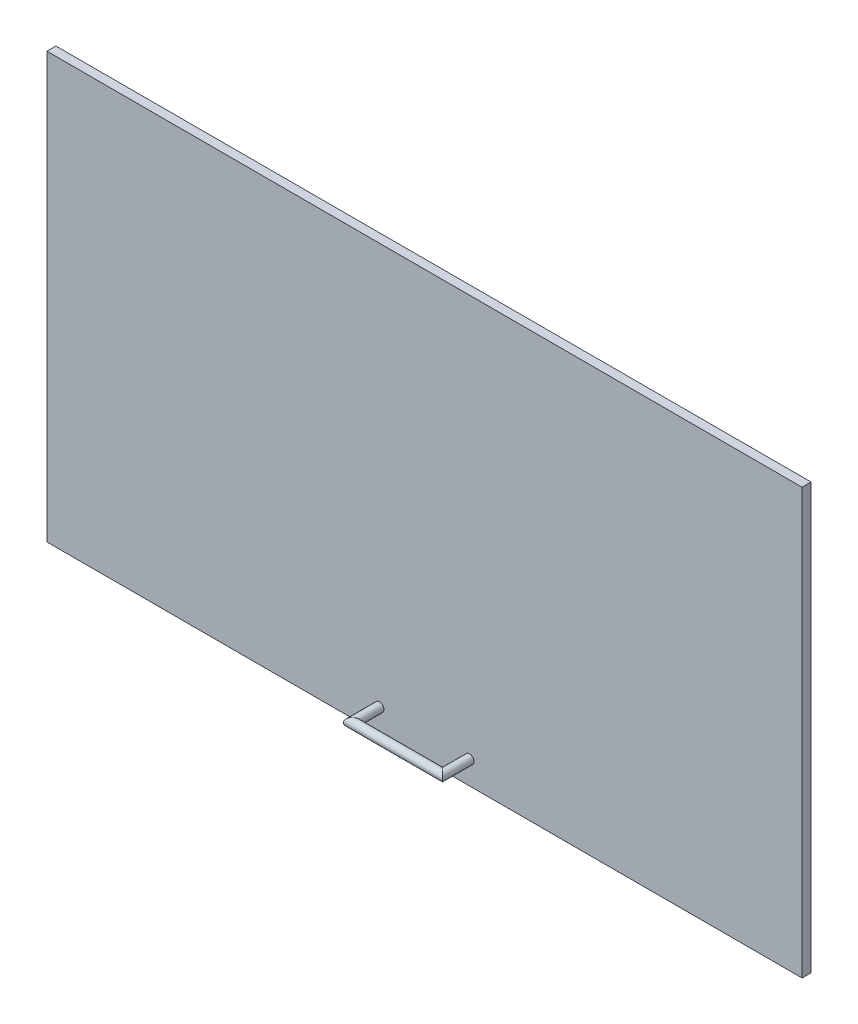
ISO-10303-21;
HEADER;
FILE_DESCRIPTION(('STEP AP214'),'2;1');
FILE_NAME('part.step','',(''),(''),'','','');
FILE_SCHEMA(('AUTOMOTIVE_DESIGN { 1 0 10303 214 1 1 1 1 }'));
ENDSEC;
DATA;
#1=APPLICATION_CONTEXT('core data for automotive mechanical design processes');
#2=APPLICATION_PROTOCOL_DEFINITION('international standard','automotive_design',2000,#1);
#3=PRODUCT_CONTEXT('',#1,'mechanical');
#4=PRODUCT('Part','Part','',(#3));
#5=PRODUCT_RELATED_PRODUCT_CATEGORY('part','',(#4));
#6=PRODUCT_DEFINITION_FORMATION('','',#4);
#7=PRODUCT_DEFINITION_CONTEXT('part definition',#1,'design');
#8=PRODUCT_DEFINITION('design','',#6,#7);
#9=PRODUCT_DEFINITION_SHAPE('','',#8);
#10=(LENGTH_UNIT() NAMED_UNIT(*) SI_UNIT(.MILLI.,.METRE.));
#11=(NAMED_UNIT(*) PLANE_ANGLE_UNIT() SI_UNIT($,.RADIAN.));
#12=(NAMED_UNIT(*) SI_UNIT($,.STERADIAN.) SOLID_ANGLE_UNIT());
#13=UNCERTAINTY_MEASURE_WITH_UNIT(LENGTH_MEASURE(1.E-05),#10,'distance_accuracy_value','');
#14=(GEOMETRIC_REPRESENTATION_CONTEXT(3) GLOBAL_UNCERTAINTY_ASSIGNED_CONTEXT((#13)) GLOBAL_UNIT_ASSIGNED_CONTEXT((#10,
#11,#12)) REPRESENTATION_CONTEXT('',''));
#15=CARTESIAN_POINT('',(0.,0.,0.));
#16=DIRECTION('',(0.,0.,1.));
#17=DIRECTION('',(1.,0.,0.));
#18=AXIS2_PLACEMENT_3D('',#15,#16,#17);
#19=CARTESIAN_POINT('',(0.,0.,10.));
#20=DIRECTION('',(0.,0.,-1.));
#21=DIRECTION('',(-1.,0.,0.));
#22=AXIS2_PLACEMENT_3D('',#19,#20,#21);
#23=PLANE('',#22);
#24=CARTESIAN_POINT('',(50.,-210.,10.));
#25=DIRECTION('',(0.,0.,1.));
#26=DIRECTION('',(1.,0.,0.));
#27=AXIS2_PLACEMENT_3D('',#24,#25,#26);
#28=CIRCLE('',#27,4.99999999999999);
#29=CARTESIAN_POINT('',(55.,-210.,10.));
#30=VERTEX_POINT('',#29);
#31=EDGE_CURVE('E11',#30,#30,#28,.T.);
#32=ORIENTED_EDGE('',*,*,#31,.F.);
#33=EDGE_LOOP('',(#32));
#34=FACE_BOUND('',#33,.T.);
#35=DIRECTION('',(0.,1.,0.));
#36=VECTOR('',#35,1.);
#37=CARTESIAN_POINT('',(419.24,-235.955,10.));
#38=LINE('',#37,#36);
#39=CARTESIAN_POINT('',(419.24,-235.955,10.));
#40=VERTEX_POINT('',#39);
#41=CARTESIAN_POINT('',(419.24,235.955,10.));
#42=VERTEX_POINT('',#41);
#43=EDGE_CURVE('E111',#40,#42,#38,.T.);
#44=ORIENTED_EDGE('',*,*,#43,.T.);
#45=DIRECTION('',(-1.,0.,0.));
#46=VECTOR('',#45,1.);
#47=CARTESIAN_POINT('',(-419.24,235.955,10.));
#48=LINE('',#47,#46);
#49=CARTESIAN_POINT('',(-419.24,235.955,10.));
#50=VERTEX_POINT('',#49);
#51=EDGE_CURVE('E87',#42,#50,#48,.T.);
#52=ORIENTED_EDGE('',*,*,#51,.T.);
#53=DIRECTION('',(0.,-1.,0.));
#54=VECTOR('',#53,1.);
#55=CARTESIAN_POINT('',(-419.24,-235.955,10.));
#56=LINE('',#55,#54);
#57=CARTESIAN_POINT('',(-419.24,-235.955,10.));
#58=VERTEX_POINT('',#57);
#59=EDGE_CURVE('E114',#50,#58,#56,.T.);
#60=ORIENTED_EDGE('',*,*,#59,.T.);
#61=DIRECTION('',(1.,0.,0.));
#62=VECTOR('',#61,1.);
#63=CARTESIAN_POINT('',(-419.24,-235.955,10.));
#64=LINE('',#63,#62);
#65=EDGE_CURVE('E55',#58,#40,#64,.T.);
#66=ORIENTED_EDGE('',*,*,#65,.T.);
#67=EDGE_LOOP('',(#44,#52,#60,#66));
#68=FACE_BOUND('',#67,.T.);
#69=CARTESIAN_POINT('',(-50.,-210.,10.));
#70=DIRECTION('',(0.,0.,-1.));
#71=DIRECTION('',(-1.,0.,0.));
#72=AXIS2_PLACEMENT_3D('',#69,#70,#71);
#73=CIRCLE('',#72,4.99999999999999);
#74=CARTESIAN_POINT('',(-55.,-210.,10.));
#75=VERTEX_POINT('',#74);
#76=EDGE_CURVE('E106',#75,#75,#73,.T.);
#77=ORIENTED_EDGE('',*,*,#76,.T.);
#78=EDGE_LOOP('',(#77));
#79=FACE_BOUND('',#78,.T.);
#80=ADVANCED_FACE('F37',(#34,#68,#79),#23,.F.);
#81=CARTESIAN_POINT('',(419.24,-235.955,10.));
#82=DIRECTION('',(-1.,0.,0.));
#83=DIRECTION('',(0.,0.,1.));
#84=AXIS2_PLACEMENT_3D('',#81,#82,#83);
#85=PLANE('',#84);
#86=DIRECTION('',(0.,1.,0.));
#87=VECTOR('',#86,1.);
#88=CARTESIAN_POINT('',(419.24,-235.955,0.));
#89=LINE('',#88,#87);
#90=CARTESIAN_POINT('',(419.24,-235.955,0.));
#91=VERTEX_POINT('',#90);
#92=CARTESIAN_POINT('',(419.24,235.955,0.));
#93=VERTEX_POINT('',#92);
#94=EDGE_CURVE('E99',#91,#93,#89,.T.);
#95=ORIENTED_EDGE('',*,*,#94,.T.);
#96=DIRECTION('',(0.,0.,-1.));
#97=VECTOR('',#96,1.);
#98=CARTESIAN_POINT('',(419.24,235.955,10.));
#99=LINE('',#98,#97);
#100=EDGE_CURVE('E41',#42,#93,#99,.T.);
#101=ORIENTED_EDGE('',*,*,#100,.F.);
#102=ORIENTED_EDGE('',*,*,#43,.F.);
#103=DIRECTION('',(0.,0.,-1.));
#104=VECTOR('',#103,1.);
#105=CARTESIAN_POINT('',(419.24,-235.955,10.));
#106=LINE('',#105,#104);
#107=EDGE_CURVE('E116',#40,#91,#106,.T.);
#108=ORIENTED_EDGE('',*,*,#107,.T.);
#109=EDGE_LOOP('',(#95,#101,#102,#108));
#110=FACE_BOUND('',#109,.T.);
#111=ADVANCED_FACE('F39',(#110),#85,.F.);
#112=CARTESIAN_POINT('',(-419.24,235.955,10.));
#113=DIRECTION('',(0.,-1.,0.));
#114=DIRECTION('',(0.,0.,-1.));
#115=AXIS2_PLACEMENT_3D('',#112,#113,#114);
#116=PLANE('',#115);
#117=DIRECTION('',(-1.,0.,0.));
#118=VECTOR('',#117,1.);
#119=CARTESIAN_POINT('',(-419.24,235.955,0.));
#120=LINE('',#119,#118);
#121=CARTESIAN_POINT('',(-419.24,235.955,0.));
#122=VERTEX_POINT('',#121);
#123=EDGE_CURVE('E103',#93,#122,#120,.T.);
#124=ORIENTED_EDGE('',*,*,#123,.T.);
#125=DIRECTION('',(0.,0.,-1.));
#126=VECTOR('',#125,1.);
#127=CARTESIAN_POINT('',(-419.24,235.955,10.));
#128=LINE('',#127,#126);
#129=EDGE_CURVE('E123',#50,#122,#128,.T.);
#130=ORIENTED_EDGE('',*,*,#129,.F.);
#131=ORIENTED_EDGE('',*,*,#51,.F.);
#132=ORIENTED_EDGE('',*,*,#100,.T.);
#133=EDGE_LOOP('',(#124,#130,#131,#132));
#134=FACE_BOUND('',#133,.T.);
#135=ADVANCED_FACE('F126',(#134),#116,.F.);
#136=CARTESIAN_POINT('',(-419.24,-235.955,10.));
#137=DIRECTION('',(1.,0.,0.));
#138=DIRECTION('',(0.,0.,-1.));
#139=AXIS2_PLACEMENT_3D('',#136,#137,#138);
#140=PLANE('',#139);
#141=DIRECTION('',(0.,-1.,0.));
#142=VECTOR('',#141,1.);
#143=CARTESIAN_POINT('',(-419.24,-235.955,0.));
#144=LINE('',#143,#142);
#145=CARTESIAN_POINT('',(-419.24,-235.955,0.));
#146=VERTEX_POINT('',#145);
#147=EDGE_CURVE('E73',#122,#146,#144,.T.);
#148=ORIENTED_EDGE('',*,*,#147,.T.);
#149=DIRECTION('',(0.,0.,-1.));
#150=VECTOR('',#149,1.);
#151=CARTESIAN_POINT('',(-419.24,-235.955,10.));
#152=LINE('',#151,#150);
#153=EDGE_CURVE('E122',#58,#146,#152,.T.);
#154=ORIENTED_EDGE('',*,*,#153,.F.);
#155=ORIENTED_EDGE('',*,*,#59,.F.);
#156=ORIENTED_EDGE('',*,*,#129,.T.);
#157=EDGE_LOOP('',(#148,#154,#155,#156));
#158=FACE_BOUND('',#157,.T.);
#159=ADVANCED_FACE('F143',(#158),#140,.F.);
#160=CARTESIAN_POINT('',(-419.24,-235.955,10.));
#161=DIRECTION('',(0.,1.,0.));
#162=DIRECTION('',(0.,0.,1.));
#163=AXIS2_PLACEMENT_3D('',#160,#161,#162);
#164=PLANE('',#163);
#165=DIRECTION('',(1.,0.,0.));
#166=VECTOR('',#165,1.);
#167=CARTESIAN_POINT('',(-419.24,-235.955,0.));
#168=LINE('',#167,#166);
#169=EDGE_CURVE('E79',#146,#91,#168,.T.);
#170=ORIENTED_EDGE('',*,*,#169,.T.);
#171=ORIENTED_EDGE('',*,*,#107,.F.);
#172=ORIENTED_EDGE('',*,*,#65,.F.);
#173=ORIENTED_EDGE('',*,*,#153,.T.);
#174=EDGE_LOOP('',(#170,#171,#172,#173));
#175=FACE_BOUND('',#174,.T.);
#176=ADVANCED_FACE('F134',(#175),#164,.F.);
#177=CARTESIAN_POINT('',(0.,0.,0.));
#178=DIRECTION('',(0.,0.,-1.));
#179=DIRECTION('',(-1.,0.,0.));
#180=AXIS2_PLACEMENT_3D('',#177,#178,#179);
#181=PLANE('',#180);
#182=ORIENTED_EDGE('',*,*,#94,.F.);
#183=ORIENTED_EDGE('',*,*,#169,.F.);
#184=ORIENTED_EDGE('',*,*,#147,.F.);
#185=ORIENTED_EDGE('',*,*,#123,.F.);
#186=EDGE_LOOP('',(#182,#183,#184,#185));
#187=FACE_BOUND('',#186,.T.);
#188=ADVANCED_FACE('F131',(#187),#181,.T.);
#189=CARTESIAN_POINT('',(-50.,-210.,45.6));
#190=DIRECTION('',(0.,0.,-1.));
#191=DIRECTION('',(-1.,0.,0.));
#192=AXIS2_PLACEMENT_3D('',#189,#190,#191);
#193=CYLINDRICAL_SURFACE('',#192,4.99999999999999);
#194=CARTESIAN_POINT('',(-50.,-210.,40.));
#195=DIRECTION('',(-0.707106781186548,0.,-0.707106781186548));
#196=DIRECTION('',(-0.707106781186548,0.,0.707106781186548));
#197=AXIS2_PLACEMENT_3D('',#194,#195,#196);
#198=ELLIPSE('',#197,7.07106781186546,4.99999999999999);
#199=CARTESIAN_POINT('',(-55.,-210.,45.));
#200=VERTEX_POINT('',#199);
#201=EDGE_CURVE('E100',#200,#200,#198,.F.);
#202=ORIENTED_EDGE('',*,*,#201,.F.);
#203=EDGE_LOOP('',(#202));
#204=FACE_BOUND('',#203,.T.);
#205=ORIENTED_EDGE('',*,*,#76,.F.);
#206=EDGE_LOOP('',(#205));
#207=FACE_BOUND('',#206,.T.);
#208=ADVANCED_FACE('F133',(#204,#207),#193,.T.);
#209=CARTESIAN_POINT('',(55.5999999999998,-210.,40.));
#210=DIRECTION('',(-1.,0.,0.));
#211=DIRECTION('',(0.,0.,1.));
#212=AXIS2_PLACEMENT_3D('',#209,#210,#211);
#213=CYLINDRICAL_SURFACE('',#212,4.99999999999999);
#214=CARTESIAN_POINT('',(49.9999999999999,-210.,40.));
#215=DIRECTION('',(-0.707106781186549,0.,0.707106781186546));
#216=DIRECTION('',(0.707106781186546,0.,0.707106781186549));
#217=AXIS2_PLACEMENT_3D('',#214,#215,#216);
#218=ELLIPSE('',#217,7.07106781186545,4.99999999999999);
#219=CARTESIAN_POINT('',(54.9999999999999,-210.,45.));
#220=VERTEX_POINT('',#219);
#221=EDGE_CURVE('E95',#220,#220,#218,.F.);
#222=ORIENTED_EDGE('',*,*,#221,.F.);
#223=EDGE_LOOP('',(#222));
#224=FACE_BOUND('',#223,.T.);
#225=ORIENTED_EDGE('',*,*,#201,.T.);
#226=EDGE_LOOP('',(#225));
#227=FACE_BOUND('',#226,.T.);
#228=ADVANCED_FACE('F96',(#224,#227),#213,.T.);
#229=CARTESIAN_POINT('',(50.,-210.,10.));
#230=DIRECTION('',(0.,0.,1.));
#231=DIRECTION('',(1.,0.,0.));
#232=AXIS2_PLACEMENT_3D('',#229,#230,#231);
#233=CYLINDRICAL_SURFACE('',#232,4.99999999999999);
#234=ORIENTED_EDGE('',*,*,#31,.T.);
#235=EDGE_LOOP('',(#234));
#236=FACE_BOUND('',#235,.T.);
#237=ORIENTED_EDGE('',*,*,#221,.T.);
#238=EDGE_LOOP('',(#237));
#239=FACE_BOUND('',#238,.T.);
#240=ADVANCED_FACE('F136',(#236,#239),#233,.T.);
#241=CLOSED_SHELL('',(#80,#111,#135,#159,#176,#188,#208,#228,#240));
#242=MANIFOLD_SOLID_BREP('B2',#241);
#243=ADVANCED_BREP_SHAPE_REPRESENTATION('',(#18,#242),#14);
#244=SHAPE_DEFINITION_REPRESENTATION(#9,#243);
ENDSEC;
END-ISO-10303-21;
